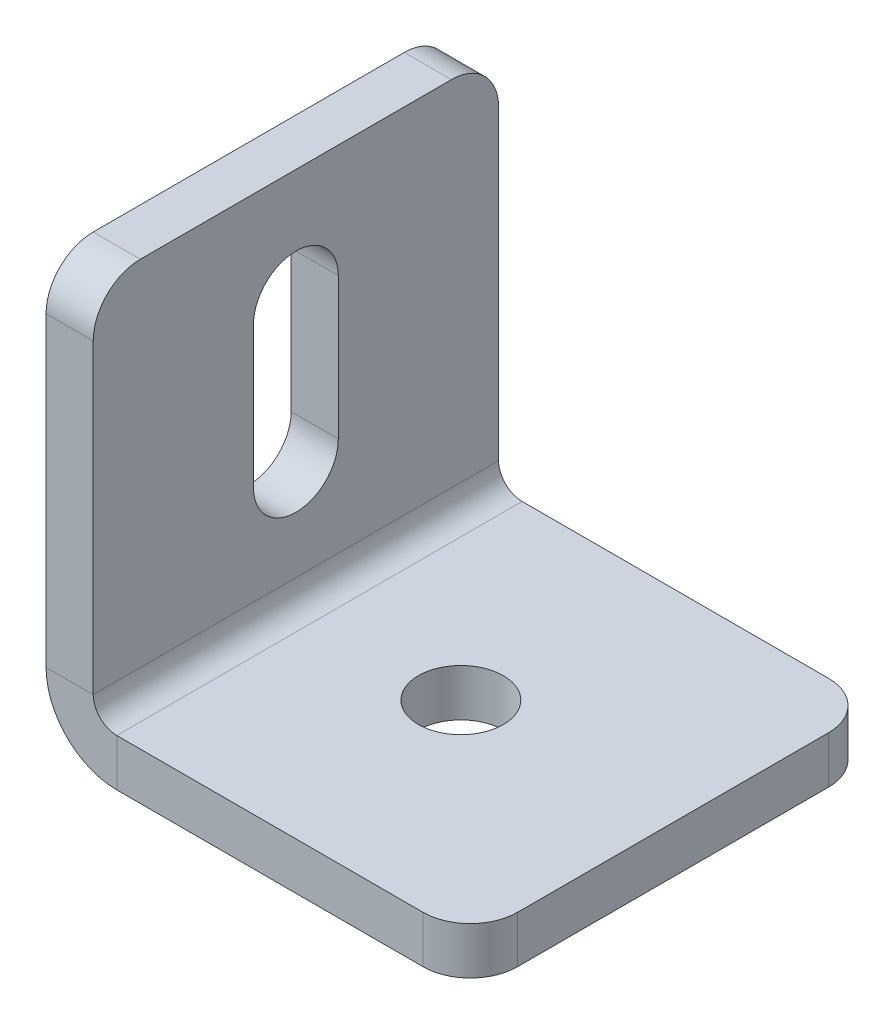
ISO-10303-21;
HEADER;
FILE_DESCRIPTION(('STEP AP214'),'2;1');
FILE_NAME('part.step','',(''),(''),'','','');
FILE_SCHEMA(('AUTOMOTIVE_DESIGN { 1 0 10303 214 1 1 1 1 }'));
ENDSEC;
DATA;
#1=APPLICATION_CONTEXT('core data for automotive mechanical design processes');
#2=APPLICATION_PROTOCOL_DEFINITION('international standard','automotive_design',2000,#1);
#3=PRODUCT_CONTEXT('',#1,'mechanical');
#4=PRODUCT('Part','Part','',(#3));
#5=PRODUCT_RELATED_PRODUCT_CATEGORY('part','',(#4));
#6=PRODUCT_DEFINITION_FORMATION('','',#4);
#7=PRODUCT_DEFINITION_CONTEXT('part definition',#1,'design');
#8=PRODUCT_DEFINITION('design','',#6,#7);
#9=PRODUCT_DEFINITION_SHAPE('','',#8);
#10=(LENGTH_UNIT() NAMED_UNIT(*) SI_UNIT(.MILLI.,.METRE.));
#11=(NAMED_UNIT(*) PLANE_ANGLE_UNIT() SI_UNIT($,.RADIAN.));
#12=(NAMED_UNIT(*) SI_UNIT($,.STERADIAN.) SOLID_ANGLE_UNIT());
#13=UNCERTAINTY_MEASURE_WITH_UNIT(LENGTH_MEASURE(1.E-05),#10,'distance_accuracy_value','');
#14=(GEOMETRIC_REPRESENTATION_CONTEXT(3) GLOBAL_UNCERTAINTY_ASSIGNED_CONTEXT((#13)) GLOBAL_UNIT_ASSIGNED_CONTEXT((#10,
#11,#12)) REPRESENTATION_CONTEXT('',''));
#15=CARTESIAN_POINT('',(0.,0.,0.));
#16=DIRECTION('',(0.,0.,1.));
#17=DIRECTION('',(1.,0.,0.));
#18=AXIS2_PLACEMENT_3D('',#15,#16,#17);
#19=CARTESIAN_POINT('',(0.,18.,0.));
#20=DIRECTION('',(-1.,0.,0.));
#21=DIRECTION('',(0.,0.,1.));
#22=AXIS2_PLACEMENT_3D('',#19,#20,#21);
#23=CYLINDRICAL_SURFACE('',#22,4.5);
#24=CARTESIAN_POINT('',(5.,18.,0.));
#25=DIRECTION('',(1.,0.,0.));
#26=DIRECTION('',(0.,0.,-1.));
#27=AXIS2_PLACEMENT_3D('',#24,#25,#26);
#28=CIRCLE('',#27,4.5);
#29=CARTESIAN_POINT('',(5.,18.,4.5));
#30=VERTEX_POINT('',#29);
#31=CARTESIAN_POINT('',(5.,18.,-4.5));
#32=VERTEX_POINT('',#31);
#33=EDGE_CURVE('E283',#30,#32,#28,.T.);
#34=ORIENTED_EDGE('',*,*,#33,.T.);
#35=DIRECTION('',(1.,0.,0.));
#36=VECTOR('',#35,1.);
#37=CARTESIAN_POINT('',(0.,18.,-4.5));
#38=LINE('',#37,#36);
#39=CARTESIAN_POINT('',(0.,18.,-4.5));
#40=VERTEX_POINT('',#39);
#41=EDGE_CURVE('E203',#40,#32,#38,.T.);
#42=ORIENTED_EDGE('',*,*,#41,.F.);
#43=CARTESIAN_POINT('',(0.,18.,0.));
#44=DIRECTION('',(1.,0.,0.));
#45=DIRECTION('',(0.,0.,-1.));
#46=AXIS2_PLACEMENT_3D('',#43,#44,#45);
#47=CIRCLE('',#46,4.5);
#48=CARTESIAN_POINT('',(0.,18.,4.5));
#49=VERTEX_POINT('',#48);
#50=EDGE_CURVE('E208',#49,#40,#47,.T.);
#51=ORIENTED_EDGE('',*,*,#50,.F.);
#52=DIRECTION('',(1.,0.,0.));
#53=VECTOR('',#52,1.);
#54=CARTESIAN_POINT('',(0.,18.,4.5));
#55=LINE('',#54,#53);
#56=EDGE_CURVE('E170',#49,#30,#55,.T.);
#57=ORIENTED_EDGE('',*,*,#56,.T.);
#58=EDGE_LOOP('',(#34,#42,#51,#57));
#59=FACE_BOUND('',#58,.T.);
#60=ADVANCED_FACE('F48',(#59),#23,.F.);
#61=CARTESIAN_POINT('',(0.,0.,21.5));
#62=DIRECTION('',(0.,0.,-1.));
#63=DIRECTION('',(0.,-1.,0.));
#64=AXIS2_PLACEMENT_3D('',#61,#62,#63);
#65=PLANE('',#64);
#66=DIRECTION('',(0.,1.,0.));
#67=VECTOR('',#66,1.);
#68=CARTESIAN_POINT('',(5.,0.,21.5));
#69=LINE('',#68,#67);
#70=CARTESIAN_POINT('',(5.,40.,21.5));
#71=VERTEX_POINT('',#70);
#72=CARTESIAN_POINT('',(5.,7.5,21.5));
#73=VERTEX_POINT('',#72);
#74=EDGE_CURVE('E289',#71,#73,#69,.F.);
#75=ORIENTED_EDGE('',*,*,#74,.F.);
#76=DIRECTION('',(1.,0.,0.));
#77=VECTOR('',#76,1.);
#78=CARTESIAN_POINT('',(0.,40.,21.5));
#79=LINE('',#78,#77);
#80=CARTESIAN_POINT('',(0.,40.,21.5));
#81=VERTEX_POINT('',#80);
#82=EDGE_CURVE('E11',#71,#81,#79,.F.);
#83=ORIENTED_EDGE('',*,*,#82,.T.);
#84=DIRECTION('',(0.,-1.,0.));
#85=VECTOR('',#84,1.);
#86=CARTESIAN_POINT('',(0.,0.,21.5));
#87=LINE('',#86,#85);
#88=CARTESIAN_POINT('',(0.,7.5,21.5));
#89=VERTEX_POINT('',#88);
#90=EDGE_CURVE('E211',#81,#89,#87,.T.);
#91=ORIENTED_EDGE('',*,*,#90,.T.);
#92=DIRECTION('',(-1.,0.,0.));
#93=VECTOR('',#92,1.);
#94=CARTESIAN_POINT('',(0.,7.5,21.5));
#95=LINE('',#94,#93);
#96=EDGE_CURVE('E305',#73,#89,#95,.T.);
#97=ORIENTED_EDGE('',*,*,#96,.F.);
#98=EDGE_LOOP('',(#75,#83,#91,#97));
#99=FACE_BOUND('',#98,.T.);
#100=ADVANCED_FACE('F385',(#99),#65,.F.);
#101=CARTESIAN_POINT('',(0.,45.,-21.5));
#102=DIRECTION('',(0.,-1.,0.));
#103=DIRECTION('',(0.,0.,1.));
#104=AXIS2_PLACEMENT_3D('',#101,#102,#103);
#105=PLANE('',#104);
#106=DIRECTION('',(0.,0.,1.));
#107=VECTOR('',#106,1.);
#108=CARTESIAN_POINT('',(5.,45.,-21.5));
#109=LINE('',#108,#107);
#110=CARTESIAN_POINT('',(5.,45.,-16.5));
#111=VERTEX_POINT('',#110);
#112=CARTESIAN_POINT('',(5.,45.,16.5));
#113=VERTEX_POINT('',#112);
#114=EDGE_CURVE('E286',#111,#113,#109,.T.);
#115=ORIENTED_EDGE('',*,*,#114,.F.);
#116=DIRECTION('',(-1.,0.,0.));
#117=VECTOR('',#116,1.);
#118=CARTESIAN_POINT('',(0.,45.,-16.5));
#119=LINE('',#118,#117);
#120=CARTESIAN_POINT('',(0.,45.,-16.5));
#121=VERTEX_POINT('',#120);
#122=EDGE_CURVE('E340',#111,#121,#119,.T.);
#123=ORIENTED_EDGE('',*,*,#122,.T.);
#124=DIRECTION('',(0.,0.,1.));
#125=VECTOR('',#124,1.);
#126=CARTESIAN_POINT('',(0.,45.,-21.5));
#127=LINE('',#126,#125);
#128=CARTESIAN_POINT('',(0.,45.,16.5));
#129=VERTEX_POINT('',#128);
#130=EDGE_CURVE('E215',#121,#129,#127,.T.);
#131=ORIENTED_EDGE('',*,*,#130,.T.);
#132=DIRECTION('',(1.,0.,0.));
#133=VECTOR('',#132,1.);
#134=CARTESIAN_POINT('',(0.,45.,16.5));
#135=LINE('',#134,#133);
#136=EDGE_CURVE('E337',#129,#113,#135,.T.);
#137=ORIENTED_EDGE('',*,*,#136,.T.);
#138=EDGE_LOOP('',(#115,#123,#131,#137));
#139=FACE_BOUND('',#138,.T.);
#140=ADVANCED_FACE('F365',(#139),#105,.F.);
#141=CARTESIAN_POINT('',(0.,0.,-21.5));
#142=DIRECTION('',(0.,0.,-1.));
#143=DIRECTION('',(0.,-1.,0.));
#144=AXIS2_PLACEMENT_3D('',#141,#142,#143);
#145=PLANE('',#144);
#146=DIRECTION('',(0.,-1.,0.));
#147=VECTOR('',#146,1.);
#148=CARTESIAN_POINT('',(0.,0.,-21.5));
#149=LINE('',#148,#147);
#150=CARTESIAN_POINT('',(0.,40.,-21.5));
#151=VERTEX_POINT('',#150);
#152=CARTESIAN_POINT('',(0.,7.5,-21.5));
#153=VERTEX_POINT('',#152);
#154=EDGE_CURVE('E219',#151,#153,#149,.T.);
#155=ORIENTED_EDGE('',*,*,#154,.F.);
#156=DIRECTION('',(1.,0.,0.));
#157=VECTOR('',#156,1.);
#158=CARTESIAN_POINT('',(0.,40.,-21.5));
#159=LINE('',#158,#157);
#160=CARTESIAN_POINT('',(5.,40.,-21.5));
#161=VERTEX_POINT('',#160);
#162=EDGE_CURVE('E350',#151,#161,#159,.T.);
#163=ORIENTED_EDGE('',*,*,#162,.T.);
#164=DIRECTION('',(0.,1.,0.));
#165=VECTOR('',#164,1.);
#166=CARTESIAN_POINT('',(5.,0.,-21.5));
#167=LINE('',#166,#165);
#168=CARTESIAN_POINT('',(5.,7.5,-21.5));
#169=VERTEX_POINT('',#168);
#170=EDGE_CURVE('E268',#161,#169,#167,.F.);
#171=ORIENTED_EDGE('',*,*,#170,.T.);
#172=DIRECTION('',(-1.,0.,0.));
#173=VECTOR('',#172,1.);
#174=CARTESIAN_POINT('',(0.,7.5,-21.5));
#175=LINE('',#174,#173);
#176=EDGE_CURVE('E301',#169,#153,#175,.T.);
#177=ORIENTED_EDGE('',*,*,#176,.T.);
#178=EDGE_LOOP('',(#155,#163,#171,#177));
#179=FACE_BOUND('',#178,.T.);
#180=ADVANCED_FACE('F371',(#179),#145,.T.);
#181=CARTESIAN_POINT('',(7.5,7.5,-21.5));
#182=DIRECTION('',(0.,0.,1.));
#183=DIRECTION('',(1.,0.,0.));
#184=AXIS2_PLACEMENT_3D('',#181,#182,#183);
#185=PLANE('',#184);
#186=ORIENTED_EDGE('',*,*,#176,.F.);
#187=CARTESIAN_POINT('',(7.5,7.5,-21.5));
#188=DIRECTION('',(0.,0.,1.));
#189=DIRECTION('',(1.,0.,0.));
#190=AXIS2_PLACEMENT_3D('',#187,#188,#189);
#191=CIRCLE('',#190,2.5);
#192=CARTESIAN_POINT('',(7.5,5.,-21.5));
#193=VERTEX_POINT('',#192);
#194=EDGE_CURVE('E279',#169,#193,#191,.T.);
#195=ORIENTED_EDGE('',*,*,#194,.T.);
#196=DIRECTION('',(0.,-1.,0.));
#197=VECTOR('',#196,1.);
#198=CARTESIAN_POINT('',(7.50000000000001,0.,-21.5));
#199=LINE('',#198,#197);
#200=CARTESIAN_POINT('',(7.50000000000001,0.,-21.5));
#201=VERTEX_POINT('',#200);
#202=EDGE_CURVE('E298',#193,#201,#199,.T.);
#203=ORIENTED_EDGE('',*,*,#202,.T.);
#204=CARTESIAN_POINT('',(7.5,7.5,-21.5));
#205=DIRECTION('',(0.,0.,-1.));
#206=DIRECTION('',(-1.,0.,0.));
#207=AXIS2_PLACEMENT_3D('',#204,#205,#206);
#208=CIRCLE('',#207,7.5);
#209=EDGE_CURVE('E212',#153,#201,#208,.F.);
#210=ORIENTED_EDGE('',*,*,#209,.F.);
#211=EDGE_LOOP('',(#186,#195,#203,#210));
#212=FACE_BOUND('',#211,.T.);
#213=ADVANCED_FACE('F376',(#212),#185,.F.);
#214=CARTESIAN_POINT('',(45.,0.,-21.5));
#215=DIRECTION('',(0.,0.,-1.));
#216=DIRECTION('',(1.,0.,0.));
#217=AXIS2_PLACEMENT_3D('',#214,#215,#216);
#218=PLANE('',#217);
#219=DIRECTION('',(1.,0.,0.));
#220=VECTOR('',#219,1.);
#221=CARTESIAN_POINT('',(45.,5.,-21.5));
#222=LINE('',#221,#220);
#223=CARTESIAN_POINT('',(40.,5.,-21.5));
#224=VERTEX_POINT('',#223);
#225=EDGE_CURVE('E262',#193,#224,#222,.T.);
#226=ORIENTED_EDGE('',*,*,#225,.T.);
#227=DIRECTION('',(0.,-1.,0.));
#228=VECTOR('',#227,1.);
#229=CARTESIAN_POINT('',(40.,0.,-21.5));
#230=LINE('',#229,#228);
#231=CARTESIAN_POINT('',(40.,0.,-21.5));
#232=VERTEX_POINT('',#231);
#233=EDGE_CURVE('E309',#224,#232,#230,.T.);
#234=ORIENTED_EDGE('',*,*,#233,.T.);
#235=DIRECTION('',(1.,0.,0.));
#236=VECTOR('',#235,1.);
#237=CARTESIAN_POINT('',(45.,0.,-21.5));
#238=LINE('',#237,#236);
#239=EDGE_CURVE('E234',#201,#232,#238,.T.);
#240=ORIENTED_EDGE('',*,*,#239,.F.);
#241=ORIENTED_EDGE('',*,*,#202,.F.);
#242=EDGE_LOOP('',(#226,#234,#240,#241));
#243=FACE_BOUND('',#242,.T.);
#244=ADVANCED_FACE('F418',(#243),#218,.T.);
#245=CARTESIAN_POINT('',(45.,0.,-21.5));
#246=DIRECTION('',(1.,0.,0.));
#247=DIRECTION('',(0.,0.,1.));
#248=AXIS2_PLACEMENT_3D('',#245,#246,#247);
#249=PLANE('',#248);
#250=DIRECTION('',(0.,0.,1.));
#251=VECTOR('',#250,1.);
#252=CARTESIAN_POINT('',(45.,0.,-21.5));
#253=LINE('',#252,#251);
#254=CARTESIAN_POINT('',(45.,0.,-16.5));
#255=VERTEX_POINT('',#254);
#256=CARTESIAN_POINT('',(45.,0.,16.5));
#257=VERTEX_POINT('',#256);
#258=EDGE_CURVE('E226',#255,#257,#253,.T.);
#259=ORIENTED_EDGE('',*,*,#258,.F.);
#260=DIRECTION('',(0.,-1.,0.));
#261=VECTOR('',#260,1.);
#262=CARTESIAN_POINT('',(45.,0.,-16.5));
#263=LINE('',#262,#261);
#264=CARTESIAN_POINT('',(45.,5.,-16.5));
#265=VERTEX_POINT('',#264);
#266=EDGE_CURVE('E325',#255,#265,#263,.F.);
#267=ORIENTED_EDGE('',*,*,#266,.T.);
#268=DIRECTION('',(0.,0.,1.));
#269=VECTOR('',#268,1.);
#270=CARTESIAN_POINT('',(45.,5.,-21.5));
#271=LINE('',#270,#269);
#272=CARTESIAN_POINT('',(45.,5.,16.5));
#273=VERTEX_POINT('',#272);
#274=EDGE_CURVE('E267',#265,#273,#271,.T.);
#275=ORIENTED_EDGE('',*,*,#274,.T.);
#276=DIRECTION('',(0.,1.,0.));
#277=VECTOR('',#276,1.);
#278=CARTESIAN_POINT('',(45.,0.,16.5));
#279=LINE('',#278,#277);
#280=EDGE_CURVE('E321',#273,#257,#279,.F.);
#281=ORIENTED_EDGE('',*,*,#280,.T.);
#282=EDGE_LOOP('',(#259,#267,#275,#281));
#283=FACE_BOUND('',#282,.T.);
#284=ADVANCED_FACE('F409',(#283),#249,.T.);
#285=CARTESIAN_POINT('',(45.,0.,21.5));
#286=DIRECTION('',(0.,0.,-1.));
#287=DIRECTION('',(1.,0.,0.));
#288=AXIS2_PLACEMENT_3D('',#285,#286,#287);
#289=PLANE('',#288);
#290=DIRECTION('',(1.,0.,0.));
#291=VECTOR('',#290,1.);
#292=CARTESIAN_POINT('',(45.,0.,21.5));
#293=LINE('',#292,#291);
#294=CARTESIAN_POINT('',(7.50000000000001,0.,21.5));
#295=VERTEX_POINT('',#294);
#296=CARTESIAN_POINT('',(40.,0.,21.5));
#297=VERTEX_POINT('',#296);
#298=EDGE_CURVE('E230',#295,#297,#293,.T.);
#299=ORIENTED_EDGE('',*,*,#298,.T.);
#300=DIRECTION('',(0.,-1.,0.));
#301=VECTOR('',#300,1.);
#302=CARTESIAN_POINT('',(40.,0.,21.5));
#303=LINE('',#302,#301);
#304=CARTESIAN_POINT('',(40.,5.,21.5));
#305=VERTEX_POINT('',#304);
#306=EDGE_CURVE('E334',#297,#305,#303,.F.);
#307=ORIENTED_EDGE('',*,*,#306,.T.);
#308=DIRECTION('',(1.,0.,0.));
#309=VECTOR('',#308,1.);
#310=CARTESIAN_POINT('',(45.,5.,21.5));
#311=LINE('',#310,#309);
#312=CARTESIAN_POINT('',(7.50000000000001,5.,21.5));
#313=VERTEX_POINT('',#312);
#314=EDGE_CURVE('E269',#313,#305,#311,.T.);
#315=ORIENTED_EDGE('',*,*,#314,.F.);
#316=DIRECTION('',(0.,-1.,0.));
#317=VECTOR('',#316,1.);
#318=CARTESIAN_POINT('',(7.50000000000001,0.,21.5));
#319=LINE('',#318,#317);
#320=EDGE_CURVE('E246',#313,#295,#319,.T.);
#321=ORIENTED_EDGE('',*,*,#320,.T.);
#322=EDGE_LOOP('',(#299,#307,#315,#321));
#323=FACE_BOUND('',#322,.T.);
#324=ADVANCED_FACE('F396',(#323),#289,.F.);
#325=CARTESIAN_POINT('',(22.5,0.,0.));
#326=DIRECTION('',(0.,-1.,0.));
#327=DIRECTION('',(1.,0.,0.));
#328=AXIS2_PLACEMENT_3D('',#325,#326,#327);
#329=CYLINDRICAL_SURFACE('',#328,4.5);
#330=CARTESIAN_POINT('',(22.5,0.,0.));
#331=DIRECTION('',(0.,-1.,0.));
#332=DIRECTION('',(0.,0.,-1.));
#333=AXIS2_PLACEMENT_3D('',#330,#331,#332);
#334=CIRCLE('',#333,4.5);
#335=CARTESIAN_POINT('',(22.5,0.,-4.49999999999999));
#336=VERTEX_POINT('',#335);
#337=EDGE_CURVE('E222',#336,#336,#334,.T.);
#338=ORIENTED_EDGE('',*,*,#337,.T.);
#339=EDGE_LOOP('',(#338));
#340=FACE_BOUND('',#339,.T.);
#341=CARTESIAN_POINT('',(22.5,5.,0.));
#342=DIRECTION('',(0.,-1.,0.));
#343=DIRECTION('',(0.,0.,-1.));
#344=AXIS2_PLACEMENT_3D('',#341,#342,#343);
#345=CIRCLE('',#344,4.5);
#346=CARTESIAN_POINT('',(22.5,5.,-4.49999999999999));
#347=VERTEX_POINT('',#346);
#348=EDGE_CURVE('E263',#347,#347,#345,.T.);
#349=ORIENTED_EDGE('',*,*,#348,.F.);
#350=EDGE_LOOP('',(#349));
#351=FACE_BOUND('',#350,.T.);
#352=ADVANCED_FACE('F471',(#340,#351),#329,.F.);
#353=CARTESIAN_POINT('',(7.5,7.5,21.5));
#354=DIRECTION('',(0.,0.,-1.));
#355=DIRECTION('',(-1.,0.,0.));
#356=AXIS2_PLACEMENT_3D('',#353,#354,#355);
#357=PLANE('',#356);
#358=CARTESIAN_POINT('',(7.5,7.5,21.5));
#359=DIRECTION('',(0.,0.,1.));
#360=DIRECTION('',(1.,0.,0.));
#361=AXIS2_PLACEMENT_3D('',#358,#359,#360);
#362=CIRCLE('',#361,2.5);
#363=EDGE_CURVE('E202',#313,#73,#362,.F.);
#364=ORIENTED_EDGE('',*,*,#363,.T.);
#365=ORIENTED_EDGE('',*,*,#96,.T.);
#366=CARTESIAN_POINT('',(7.5,7.5,21.5));
#367=DIRECTION('',(0.,0.,1.));
#368=DIRECTION('',(1.,0.,0.));
#369=AXIS2_PLACEMENT_3D('',#366,#367,#368);
#370=CIRCLE('',#369,7.5);
#371=EDGE_CURVE('E247',#295,#89,#370,.F.);
#372=ORIENTED_EDGE('',*,*,#371,.F.);
#373=ORIENTED_EDGE('',*,*,#320,.F.);
#374=EDGE_LOOP('',(#364,#365,#372,#373));
#375=FACE_BOUND('',#374,.T.);
#376=ADVANCED_FACE('F388',(#375),#357,.F.);
#377=CARTESIAN_POINT('',(45.,0.,-21.5));
#378=DIRECTION('',(0.,-1.,0.));
#379=DIRECTION('',(1.,0.,0.));
#380=AXIS2_PLACEMENT_3D('',#377,#378,#379);
#381=PLANE('',#380);
#382=ORIENTED_EDGE('',*,*,#337,.F.);
#383=EDGE_LOOP('',(#382));
#384=FACE_BOUND('',#383,.T.);
#385=ORIENTED_EDGE('',*,*,#239,.T.);
#386=CARTESIAN_POINT('',(40.,0.,-16.5));
#387=DIRECTION('',(0.,-1.,0.));
#388=DIRECTION('',(1.,0.,0.));
#389=AXIS2_PLACEMENT_3D('',#386,#387,#388);
#390=CIRCLE('',#389,5.);
#391=EDGE_CURVE('E318',#232,#255,#390,.T.);
#392=ORIENTED_EDGE('',*,*,#391,.T.);
#393=ORIENTED_EDGE('',*,*,#258,.T.);
#394=CARTESIAN_POINT('',(40.,0.,16.5));
#395=DIRECTION('',(0.,-1.,0.));
#396=DIRECTION('',(1.,0.,0.));
#397=AXIS2_PLACEMENT_3D('',#394,#395,#396);
#398=CIRCLE('',#397,5.);
#399=EDGE_CURVE('E315',#257,#297,#398,.T.);
#400=ORIENTED_EDGE('',*,*,#399,.T.);
#401=ORIENTED_EDGE('',*,*,#298,.F.);
#402=DIRECTION('',(0.,0.,1.));
#403=VECTOR('',#402,1.);
#404=CARTESIAN_POINT('',(7.5,0.,-21.5));
#405=LINE('',#404,#403);
#406=EDGE_CURVE('E242',#295,#201,#405,.F.);
#407=ORIENTED_EDGE('',*,*,#406,.T.);
#408=EDGE_LOOP('',(#385,#392,#393,#400,#401,#407));
#409=FACE_BOUND('',#408,.T.);
#410=ADVANCED_FACE('F412',(#384,#409),#381,.T.);
#411=CARTESIAN_POINT('',(0.,0.,-21.5));
#412=DIRECTION('',(-1.,0.,0.));
#413=DIRECTION('',(0.,0.,1.));
#414=AXIS2_PLACEMENT_3D('',#411,#412,#413);
#415=PLANE('',#414);
#416=DIRECTION('',(0.,1.,0.));
#417=VECTOR('',#416,1.);
#418=CARTESIAN_POINT('',(0.,33.,-4.5));
#419=LINE('',#418,#417);
#420=CARTESIAN_POINT('',(0.,33.,-4.5));
#421=VERTEX_POINT('',#420);
#422=EDGE_CURVE('E171',#40,#421,#419,.T.);
#423=ORIENTED_EDGE('',*,*,#422,.T.);
#424=CARTESIAN_POINT('',(0.,33.,0.));
#425=DIRECTION('',(1.,0.,0.));
#426=DIRECTION('',(0.,0.,-1.));
#427=AXIS2_PLACEMENT_3D('',#424,#425,#426);
#428=CIRCLE('',#427,4.5);
#429=CARTESIAN_POINT('',(0.,33.,4.5));
#430=VERTEX_POINT('',#429);
#431=EDGE_CURVE('E165',#421,#430,#428,.T.);
#432=ORIENTED_EDGE('',*,*,#431,.T.);
#433=DIRECTION('',(0.,-1.,0.));
#434=VECTOR('',#433,1.);
#435=CARTESIAN_POINT('',(0.,33.,4.5));
#436=LINE('',#435,#434);
#437=EDGE_CURVE('E174',#430,#49,#436,.T.);
#438=ORIENTED_EDGE('',*,*,#437,.T.);
#439=ORIENTED_EDGE('',*,*,#50,.T.);
#440=EDGE_LOOP('',(#423,#432,#438,#439));
#441=FACE_BOUND('',#440,.T.);
#442=ORIENTED_EDGE('',*,*,#130,.F.);
#443=CARTESIAN_POINT('',(0.,40.,-16.5));
#444=DIRECTION('',(-1.,0.,0.));
#445=DIRECTION('',(0.,0.,1.));
#446=AXIS2_PLACEMENT_3D('',#443,#444,#445);
#447=CIRCLE('',#446,5.);
#448=EDGE_CURVE('E347',#121,#151,#447,.T.);
#449=ORIENTED_EDGE('',*,*,#448,.T.);
#450=ORIENTED_EDGE('',*,*,#154,.T.);
#451=DIRECTION('',(0.,0.,1.));
#452=VECTOR('',#451,1.);
#453=CARTESIAN_POINT('',(0.,7.5,-21.5));
#454=LINE('',#453,#452);
#455=EDGE_CURVE('E238',#153,#89,#454,.T.);
#456=ORIENTED_EDGE('',*,*,#455,.T.);
#457=ORIENTED_EDGE('',*,*,#90,.F.);
#458=CARTESIAN_POINT('',(0.,40.,16.5));
#459=DIRECTION('',(-1.,0.,0.));
#460=DIRECTION('',(0.,0.,1.));
#461=AXIS2_PLACEMENT_3D('',#458,#459,#460);
#462=CIRCLE('',#461,5.);
#463=EDGE_CURVE('E344',#81,#129,#462,.T.);
#464=ORIENTED_EDGE('',*,*,#463,.T.);
#465=EDGE_LOOP('',(#442,#449,#450,#456,#457,#464));
#466=FACE_BOUND('',#465,.T.);
#467=ADVANCED_FACE('F182',(#441,#466),#415,.T.);
#468=CARTESIAN_POINT('',(7.5,7.5,-21.5));
#469=DIRECTION('',(0.,0.,1.));
#470=DIRECTION('',(1.,0.,0.));
#471=AXIS2_PLACEMENT_3D('',#468,#469,#470);
#472=CYLINDRICAL_SURFACE('',#471,7.5);
#473=ORIENTED_EDGE('',*,*,#209,.T.);
#474=ORIENTED_EDGE('',*,*,#406,.F.);
#475=ORIENTED_EDGE('',*,*,#371,.T.);
#476=ORIENTED_EDGE('',*,*,#455,.F.);
#477=EDGE_LOOP('',(#473,#474,#475,#476));
#478=FACE_BOUND('',#477,.T.);
#479=ADVANCED_FACE('F380',(#478),#472,.T.);
#480=CARTESIAN_POINT('',(45.,5.,-21.5));
#481=DIRECTION('',(0.,-1.,0.));
#482=DIRECTION('',(1.,0.,0.));
#483=AXIS2_PLACEMENT_3D('',#480,#481,#482);
#484=PLANE('',#483);
#485=ORIENTED_EDGE('',*,*,#348,.T.);
#486=EDGE_LOOP('',(#485));
#487=FACE_BOUND('',#486,.T.);
#488=ORIENTED_EDGE('',*,*,#274,.F.);
#489=CARTESIAN_POINT('',(40.,5.,-16.5));
#490=DIRECTION('',(0.,-1.,0.));
#491=DIRECTION('',(1.,0.,0.));
#492=AXIS2_PLACEMENT_3D('',#489,#490,#491);
#493=CIRCLE('',#492,5.);
#494=EDGE_CURVE('E331',#265,#224,#493,.F.);
#495=ORIENTED_EDGE('',*,*,#494,.T.);
#496=ORIENTED_EDGE('',*,*,#225,.F.);
#497=DIRECTION('',(0.,0.,1.));
#498=VECTOR('',#497,1.);
#499=CARTESIAN_POINT('',(7.50000000000001,5.,-21.5));
#500=LINE('',#499,#498);
#501=EDGE_CURVE('E251',#313,#193,#500,.F.);
#502=ORIENTED_EDGE('',*,*,#501,.F.);
#503=ORIENTED_EDGE('',*,*,#314,.T.);
#504=CARTESIAN_POINT('',(40.,5.,16.5));
#505=DIRECTION('',(0.,-1.,0.));
#506=DIRECTION('',(1.,0.,0.));
#507=AXIS2_PLACEMENT_3D('',#504,#505,#506);
#508=CIRCLE('',#507,5.);
#509=EDGE_CURVE('E328',#305,#273,#508,.F.);
#510=ORIENTED_EDGE('',*,*,#509,.T.);
#511=EDGE_LOOP('',(#488,#495,#496,#502,#503,#510));
#512=FACE_BOUND('',#511,.T.);
#513=ADVANCED_FACE('F402',(#487,#512),#484,.F.);
#514=CARTESIAN_POINT('',(5.,0.,-21.5));
#515=DIRECTION('',(-1.,0.,0.));
#516=DIRECTION('',(0.,0.,1.));
#517=AXIS2_PLACEMENT_3D('',#514,#515,#516);
#518=PLANE('',#517);
#519=CARTESIAN_POINT('',(5.,33.,0.));
#520=DIRECTION('',(1.,0.,0.));
#521=DIRECTION('',(0.,0.,-1.));
#522=AXIS2_PLACEMENT_3D('',#519,#520,#521);
#523=CIRCLE('',#522,4.5);
#524=CARTESIAN_POINT('',(5.,33.,-4.5));
#525=VERTEX_POINT('',#524);
#526=CARTESIAN_POINT('',(5.,33.,4.5));
#527=VERTEX_POINT('',#526);
#528=EDGE_CURVE('E64',#525,#527,#523,.T.);
#529=ORIENTED_EDGE('',*,*,#528,.F.);
#530=DIRECTION('',(0.,1.,0.));
#531=VECTOR('',#530,1.);
#532=CARTESIAN_POINT('',(5.,33.,-4.5));
#533=LINE('',#532,#531);
#534=EDGE_CURVE('E185',#32,#525,#533,.T.);
#535=ORIENTED_EDGE('',*,*,#534,.F.);
#536=ORIENTED_EDGE('',*,*,#33,.F.);
#537=DIRECTION('',(0.,-1.,0.));
#538=VECTOR('',#537,1.);
#539=CARTESIAN_POINT('',(5.,33.,4.5));
#540=LINE('',#539,#538);
#541=EDGE_CURVE('E190',#527,#30,#540,.T.);
#542=ORIENTED_EDGE('',*,*,#541,.F.);
#543=EDGE_LOOP('',(#529,#535,#536,#542));
#544=FACE_BOUND('',#543,.T.);
#545=ORIENTED_EDGE('',*,*,#170,.F.);
#546=CARTESIAN_POINT('',(5.,40.,-16.5));
#547=DIRECTION('',(-1.,0.,0.));
#548=DIRECTION('',(0.,0.,1.));
#549=AXIS2_PLACEMENT_3D('',#546,#547,#548);
#550=CIRCLE('',#549,5.);
#551=EDGE_CURVE('E57',#161,#111,#550,.F.);
#552=ORIENTED_EDGE('',*,*,#551,.T.);
#553=ORIENTED_EDGE('',*,*,#114,.T.);
#554=CARTESIAN_POINT('',(5.,40.,16.5));
#555=DIRECTION('',(-1.,0.,0.));
#556=DIRECTION('',(0.,0.,1.));
#557=AXIS2_PLACEMENT_3D('',#554,#555,#556);
#558=CIRCLE('',#557,5.);
#559=EDGE_CURVE('E72',#113,#71,#558,.F.);
#560=ORIENTED_EDGE('',*,*,#559,.T.);
#561=ORIENTED_EDGE('',*,*,#74,.T.);
#562=DIRECTION('',(0.,0.,1.));
#563=VECTOR('',#562,1.);
#564=CARTESIAN_POINT('',(5.,7.5,-21.5));
#565=LINE('',#564,#563);
#566=EDGE_CURVE('E258',#169,#73,#565,.T.);
#567=ORIENTED_EDGE('',*,*,#566,.F.);
#568=EDGE_LOOP('',(#545,#552,#553,#560,#561,#567));
#569=FACE_BOUND('',#568,.T.);
#570=ADVANCED_FACE('F359',(#544,#569),#518,.F.);
#571=CARTESIAN_POINT('',(7.5,7.5,-21.5));
#572=DIRECTION('',(0.,0.,1.));
#573=DIRECTION('',(1.,0.,0.));
#574=AXIS2_PLACEMENT_3D('',#571,#572,#573);
#575=CYLINDRICAL_SURFACE('',#574,2.5);
#576=ORIENTED_EDGE('',*,*,#194,.F.);
#577=ORIENTED_EDGE('',*,*,#566,.T.);
#578=ORIENTED_EDGE('',*,*,#363,.F.);
#579=ORIENTED_EDGE('',*,*,#501,.T.);
#580=EDGE_LOOP('',(#576,#577,#578,#579));
#581=FACE_BOUND('',#580,.T.);
#582=ADVANCED_FACE('F394',(#581),#575,.F.);
#583=CARTESIAN_POINT('',(40.,0.,-16.5));
#584=DIRECTION('',(0.,-1.,0.));
#585=DIRECTION('',(1.,0.,0.));
#586=AXIS2_PLACEMENT_3D('',#583,#584,#585);
#587=CYLINDRICAL_SURFACE('',#586,5.);
#588=ORIENTED_EDGE('',*,*,#494,.F.);
#589=ORIENTED_EDGE('',*,*,#266,.F.);
#590=ORIENTED_EDGE('',*,*,#391,.F.);
#591=ORIENTED_EDGE('',*,*,#233,.F.);
#592=EDGE_LOOP('',(#588,#589,#590,#591));
#593=FACE_BOUND('',#592,.T.);
#594=ADVANCED_FACE('F416',(#593),#587,.T.);
#595=CARTESIAN_POINT('',(40.,0.,16.5));
#596=DIRECTION('',(0.,1.,0.));
#597=DIRECTION('',(-1.,0.,0.));
#598=AXIS2_PLACEMENT_3D('',#595,#596,#597);
#599=CYLINDRICAL_SURFACE('',#598,5.);
#600=ORIENTED_EDGE('',*,*,#509,.F.);
#601=ORIENTED_EDGE('',*,*,#306,.F.);
#602=ORIENTED_EDGE('',*,*,#399,.F.);
#603=ORIENTED_EDGE('',*,*,#280,.F.);
#604=EDGE_LOOP('',(#600,#601,#602,#603));
#605=FACE_BOUND('',#604,.T.);
#606=ADVANCED_FACE('F406',(#605),#599,.T.);
#607=CARTESIAN_POINT('',(0.,40.,-16.5));
#608=DIRECTION('',(1.,0.,0.));
#609=DIRECTION('',(0.,0.,-1.));
#610=AXIS2_PLACEMENT_3D('',#607,#608,#609);
#611=CYLINDRICAL_SURFACE('',#610,5.);
#612=ORIENTED_EDGE('',*,*,#551,.F.);
#613=ORIENTED_EDGE('',*,*,#162,.F.);
#614=ORIENTED_EDGE('',*,*,#448,.F.);
#615=ORIENTED_EDGE('',*,*,#122,.F.);
#616=EDGE_LOOP('',(#612,#613,#614,#615));
#617=FACE_BOUND('',#616,.T.);
#618=ADVANCED_FACE('F368',(#617),#611,.T.);
#619=CARTESIAN_POINT('',(0.,40.,16.5));
#620=DIRECTION('',(-1.,0.,0.));
#621=DIRECTION('',(0.,0.,1.));
#622=AXIS2_PLACEMENT_3D('',#619,#620,#621);
#623=CYLINDRICAL_SURFACE('',#622,5.);
#624=ORIENTED_EDGE('',*,*,#559,.F.);
#625=ORIENTED_EDGE('',*,*,#136,.F.);
#626=ORIENTED_EDGE('',*,*,#463,.F.);
#627=ORIENTED_EDGE('',*,*,#82,.F.);
#628=EDGE_LOOP('',(#624,#625,#626,#627));
#629=FACE_BOUND('',#628,.T.);
#630=ADVANCED_FACE('F50',(#629),#623,.T.);
#631=CARTESIAN_POINT('',(0.,33.,0.));
#632=DIRECTION('',(1.,0.,0.));
#633=DIRECTION('',(0.,0.,-1.));
#634=AXIS2_PLACEMENT_3D('',#631,#632,#633);
#635=CYLINDRICAL_SURFACE('',#634,4.5);
#636=ORIENTED_EDGE('',*,*,#528,.T.);
#637=DIRECTION('',(1.,0.,0.));
#638=VECTOR('',#637,1.);
#639=CARTESIAN_POINT('',(0.,33.,4.5));
#640=LINE('',#639,#638);
#641=EDGE_CURVE('E161',#430,#527,#640,.T.);
#642=ORIENTED_EDGE('',*,*,#641,.F.);
#643=ORIENTED_EDGE('',*,*,#431,.F.);
#644=DIRECTION('',(1.,0.,0.));
#645=VECTOR('',#644,1.);
#646=CARTESIAN_POINT('',(0.,33.,-4.5));
#647=LINE('',#646,#645);
#648=EDGE_CURVE('E199',#421,#525,#647,.T.);
#649=ORIENTED_EDGE('',*,*,#648,.T.);
#650=EDGE_LOOP('',(#636,#642,#643,#649));
#651=FACE_BOUND('',#650,.T.);
#652=ADVANCED_FACE('F163',(#651),#635,.F.);
#653=CARTESIAN_POINT('',(0.,33.,-4.5));
#654=DIRECTION('',(0.,0.,-1.));
#655=DIRECTION('',(-1.,0.,0.));
#656=AXIS2_PLACEMENT_3D('',#653,#654,#655);
#657=PLANE('',#656);
#658=ORIENTED_EDGE('',*,*,#534,.T.);
#659=ORIENTED_EDGE('',*,*,#648,.F.);
#660=ORIENTED_EDGE('',*,*,#422,.F.);
#661=ORIENTED_EDGE('',*,*,#41,.T.);
#662=EDGE_LOOP('',(#658,#659,#660,#661));
#663=FACE_BOUND('',#662,.T.);
#664=ADVANCED_FACE('F447',(#663),#657,.F.);
#665=CARTESIAN_POINT('',(0.,33.,4.5));
#666=DIRECTION('',(0.,0.,1.));
#667=DIRECTION('',(0.,-1.,0.));
#668=AXIS2_PLACEMENT_3D('',#665,#666,#667);
#669=PLANE('',#668);
#670=ORIENTED_EDGE('',*,*,#541,.T.);
#671=ORIENTED_EDGE('',*,*,#56,.F.);
#672=ORIENTED_EDGE('',*,*,#437,.F.);
#673=ORIENTED_EDGE('',*,*,#641,.T.);
#674=EDGE_LOOP('',(#670,#671,#672,#673));
#675=FACE_BOUND('',#674,.T.);
#676=ADVANCED_FACE('F175',(#675),#669,.F.);
#677=CLOSED_SHELL('',(#60,#100,#140,#180,#213,#244,#284,#324,#352,#376,#410,#467,#479,#513,#570,
#582,#594,#606,#618,#630,#652,#664,#676));
#678=MANIFOLD_SOLID_BREP('B2',#677);
#679=ADVANCED_BREP_SHAPE_REPRESENTATION('',(#18,#678),#14);
#680=SHAPE_DEFINITION_REPRESENTATION(#9,#679);
ENDSEC;
END-ISO-10303-21;
